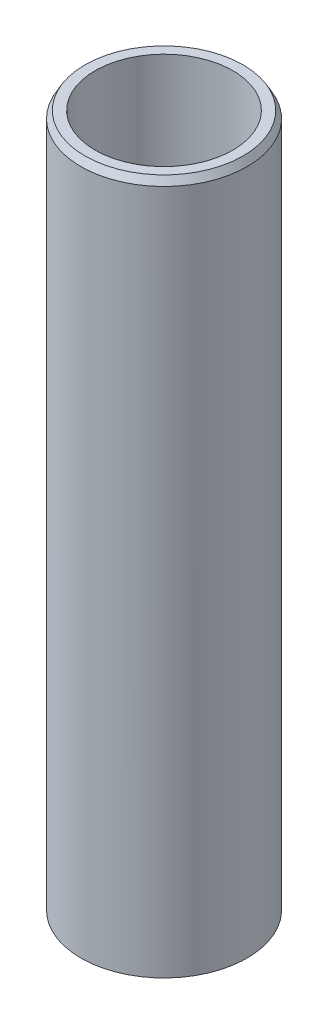
ISO-10303-21;
HEADER;
FILE_DESCRIPTION(('STEP AP214'),'2;1');
FILE_NAME('part.step','',(''),(''),'','','');
FILE_SCHEMA(('AUTOMOTIVE_DESIGN { 1 0 10303 214 1 1 1 1 }'));
ENDSEC;
DATA;
#1=APPLICATION_CONTEXT('core data for automotive mechanical design processes');
#2=APPLICATION_PROTOCOL_DEFINITION('international standard','automotive_design',2000,#1);
#3=PRODUCT_CONTEXT('',#1,'mechanical');
#4=PRODUCT('Part','Part','',(#3));
#5=PRODUCT_RELATED_PRODUCT_CATEGORY('part','',(#4));
#6=PRODUCT_DEFINITION_FORMATION('','',#4);
#7=PRODUCT_DEFINITION_CONTEXT('part definition',#1,'design');
#8=PRODUCT_DEFINITION('design','',#6,#7);
#9=PRODUCT_DEFINITION_SHAPE('','',#8);
#10=(LENGTH_UNIT() NAMED_UNIT(*) SI_UNIT(.MILLI.,.METRE.));
#11=(NAMED_UNIT(*) PLANE_ANGLE_UNIT() SI_UNIT($,.RADIAN.));
#12=(NAMED_UNIT(*) SI_UNIT($,.STERADIAN.) SOLID_ANGLE_UNIT());
#13=UNCERTAINTY_MEASURE_WITH_UNIT(LENGTH_MEASURE(1.E-05),#10,'distance_accuracy_value','');
#14=(GEOMETRIC_REPRESENTATION_CONTEXT(3) GLOBAL_UNCERTAINTY_ASSIGNED_CONTEXT((#13)) GLOBAL_UNIT_ASSIGNED_CONTEXT((#10,
#11,#12)) REPRESENTATION_CONTEXT('',''));
#15=CARTESIAN_POINT('',(0.,0.,0.));
#16=DIRECTION('',(0.,0.,1.));
#17=DIRECTION('',(1.,0.,0.));
#18=AXIS2_PLACEMENT_3D('',#15,#16,#17);
#19=CARTESIAN_POINT('',(0.,460.940624875741,0.));
#20=DIRECTION('',(0.,-1.,0.));
#21=DIRECTION('',(0.,0.,-1.));
#22=AXIS2_PLACEMENT_3D('',#19,#20,#21);
#23=CYLINDRICAL_SURFACE('',#22,55.);
#24=CARTESIAN_POINT('',(0.,456.221799142899,0.));
#25=DIRECTION('',(0.,1.,0.));
#26=DIRECTION('',(0.,0.,1.));
#27=AXIS2_PLACEMENT_3D('',#24,#25,#26);
#28=CIRCLE('',#27,55.);
#29=CARTESIAN_POINT('',(0.,456.221799142899,-55.));
#30=VERTEX_POINT('',#29);
#31=EDGE_CURVE('E50',#30,#30,#28,.F.);
#32=CARTESIAN_POINT('',(0.,2.72441530711542,0.));
#33=DIRECTION('',(0.,1.,0.));
#34=DIRECTION('',(0.,0.,1.));
#35=AXIS2_PLACEMENT_3D('',#32,#33,#34);
#36=CIRCLE('',#35,55.);
#37=CARTESIAN_POINT('',(0.,2.72441530711542,-55.));
#38=VERTEX_POINT('',#37);
#39=EDGE_CURVE('E51',#38,#38,#36,.T.);
#40=CARTESIAN_POINT('',(0.,456.221799142899,-55.));
#41=CARTESIAN_POINT('',(0.,451.497868061276,-55.));
#42=CARTESIAN_POINT('',(0.,446.773936979653,-55.));
#43=CARTESIAN_POINT('',(0.,437.326074816408,-55.));
#44=CARTESIAN_POINT('',(0.,432.602143734785,-55.));
#45=CARTESIAN_POINT('',(0.,423.154281571539,-55.));
#46=CARTESIAN_POINT('',(0.,418.430350489917,-55.));
#47=CARTESIAN_POINT('',(0.,408.982488326671,-55.));
#48=CARTESIAN_POINT('',(0.,404.258557245048,-55.));
#49=CARTESIAN_POINT('',(0.,394.810695081803,-55.));
#50=CARTESIAN_POINT('',(0.,390.08676400018,-55.));
#51=CARTESIAN_POINT('',(0.,380.638901836935,-55.));
#52=CARTESIAN_POINT('',(0.,375.914970755312,-55.));
#53=CARTESIAN_POINT('',(0.,366.467108592066,-55.));
#54=CARTESIAN_POINT('',(0.,361.743177510444,-55.));
#55=CARTESIAN_POINT('',(0.,352.295315347198,-55.));
#56=CARTESIAN_POINT('',(0.,347.571384265575,-55.));
#57=CARTESIAN_POINT('',(0.,338.12352210233,-55.));
#58=CARTESIAN_POINT('',(0.,333.399591020707,-55.));
#59=CARTESIAN_POINT('',(0.,323.951728857462,-55.));
#60=CARTESIAN_POINT('',(0.,319.227797775839,-55.));
#61=CARTESIAN_POINT('',(0.,309.779935612594,-55.));
#62=CARTESIAN_POINT('',(0.,305.056004530971,-55.));
#63=CARTESIAN_POINT('',(0.,295.608142367725,-55.));
#64=CARTESIAN_POINT('',(0.,290.884211286103,-55.));
#65=CARTESIAN_POINT('',(0.,281.436349122857,-55.));
#66=CARTESIAN_POINT('',(0.,276.712418041234,-55.));
#67=CARTESIAN_POINT('',(0.,267.264555877989,-55.));
#68=CARTESIAN_POINT('',(0.,262.540624796366,-55.));
#69=CARTESIAN_POINT('',(0.,253.092762633121,-55.));
#70=CARTESIAN_POINT('',(0.,248.368831551498,-55.));
#71=CARTESIAN_POINT('',(0.,238.920969388252,-55.));
#72=CARTESIAN_POINT('',(0.,234.19703830663,-55.));
#73=CARTESIAN_POINT('',(0.,224.749176143384,-55.));
#74=CARTESIAN_POINT('',(0.,220.025245061761,-55.));
#75=CARTESIAN_POINT('',(0.,210.577382898516,-55.));
#76=CARTESIAN_POINT('',(0.,205.853451816893,-55.));
#77=CARTESIAN_POINT('',(0.,196.405589653648,-55.));
#78=CARTESIAN_POINT('',(0.,191.681658572025,-55.));
#79=CARTESIAN_POINT('',(0.,182.23379640878,-55.));
#80=CARTESIAN_POINT('',(0.,177.509865327157,-55.));
#81=CARTESIAN_POINT('',(0.,168.062003163911,-55.));
#82=CARTESIAN_POINT('',(0.,163.338072082289,-55.));
#83=CARTESIAN_POINT('',(0.,153.890209919043,-55.));
#84=CARTESIAN_POINT('',(0.,149.16627883742,-55.));
#85=CARTESIAN_POINT('',(0.,139.718416674175,-55.));
#86=CARTESIAN_POINT('',(0.,134.994485592552,-55.));
#87=CARTESIAN_POINT('',(0.,125.546623429307,-55.));
#88=CARTESIAN_POINT('',(0.,120.822692347684,-55.));
#89=CARTESIAN_POINT('',(0.,111.374830184438,-55.));
#90=CARTESIAN_POINT('',(0.,106.650899102816,-55.));
#91=CARTESIAN_POINT('',(0.,97.2030369395702,-55.));
#92=CARTESIAN_POINT('',(0.,92.4791058579475,-55.));
#93=CARTESIAN_POINT('',(0.,83.031243694702,-55.));
#94=CARTESIAN_POINT('',(0.,78.3073126130793,-55.));
#95=CARTESIAN_POINT('',(0.,68.8594504498338,-55.));
#96=CARTESIAN_POINT('',(0.,64.135519368211,-55.));
#97=CARTESIAN_POINT('',(0.,54.6876572049656,-55.));
#98=CARTESIAN_POINT('',(0.,49.9637261233428,-55.));
#99=CARTESIAN_POINT('',(0.,40.5158639600973,-55.));
#100=CARTESIAN_POINT('',(0.,35.7919328784746,-55.));
#101=CARTESIAN_POINT('',(0.,26.3440707152291,-55.));
#102=CARTESIAN_POINT('',(0.,21.6201396336064,-55.));
#103=CARTESIAN_POINT('',(0.,12.1722774703609,-55.));
#104=CARTESIAN_POINT('',(0.,7.44834638873814,-55.));
#105=CARTESIAN_POINT('',(0.,2.72441530711542,-55.));
#106=B_SPLINE_CURVE_WITH_KNOTS('',3,(#40,#41,#42,#43,#44,#45,#46,#47,#48,#49,#50,#51,#52,#53,
#54,#55,#56,#57,#58,#59,#60,#61,#62,#63,#64,#65,#66,#67,#68,#69,#70,#71,#72,#73,#74,#75,#76,#77,
#78,#79,#80,#81,#82,#83,#84,#85,#86,#87,#88,#89,#90,#91,#92,#93,#94,#95,#96,#97,#98,#99,#100,
#101,#102,#103,#104,#105),.UNSPECIFIED.,.F.,.F.,(4,2,2,2,2,2,2,2,2,2,2,2,2,2,2,2,2,2,2,2,2,2,2,
2,2,2,2,2,2,2,2,2,4),(0.,14.1717932448682,28.3435864897364,42.5153797346047,56.6871729794729,
70.8589662243411,85.0307594692093,99.2025527140776,113.374345958946,127.546139203814,
141.717932448682,155.88972569355,170.061518938419,184.233312183287,198.405105428155,
212.576898673023,226.748691917892,240.92048516276,255.092278407628,269.264071652496,
283.435864897365,297.607658142233,311.779451387101,325.951244631969,340.123037876837,
354.294831121706,368.466624366574,382.638417611442,396.81021085631,410.982004101178,
425.153797346047,439.325590590915,453.497383835783),.UNSPECIFIED.);
#107=EDGE_CURVE('BSEAM39',#30,#38,#106,.T.);
#108=ORIENTED_EDGE('',*,*,#31,.T.);
#109=ORIENTED_EDGE('',*,*,#39,.T.);
#110=ORIENTED_EDGE('',*,*,#107,.T.);
#111=ORIENTED_EDGE('',*,*,#107,.F.);
#112=EDGE_LOOP('',(#108,#110,#109,#111));
#113=FACE_BOUND('',#112,.T.);
#114=ADVANCED_FACE('F39',(#113),#23,.T.);
#115=CARTESIAN_POINT('',(0.,460.940624875741,0.));
#116=DIRECTION('',(0.,1.,0.));
#117=DIRECTION('',(0.,0.,1.));
#118=AXIS2_PLACEMENT_3D('',#115,#116,#117);
#119=PLANE('',#118);
#120=CARTESIAN_POINT('',(0.,460.940624875741,0.));
#121=DIRECTION('',(0.,1.,0.));
#122=DIRECTION('',(0.,0.,1.));
#123=AXIS2_PLACEMENT_3D('',#120,#121,#122);
#124=CIRCLE('',#123,52.2755846928846);
#125=CARTESIAN_POINT('',(0.,460.940624875741,-52.2755846928847));
#126=VERTEX_POINT('',#125);
#127=EDGE_CURVE('E54',#126,#126,#124,.T.);
#128=ORIENTED_EDGE('',*,*,#127,.T.);
#129=EDGE_LOOP('',(#128));
#130=FACE_BOUND('',#129,.T.);
#131=CARTESIAN_POINT('',(0.,460.940624875741,0.));
#132=DIRECTION('',(0.,1.,0.));
#133=DIRECTION('',(0.,0.,1.));
#134=AXIS2_PLACEMENT_3D('',#131,#132,#133);
#135=CIRCLE('',#134,45.5773509672225);
#136=CARTESIAN_POINT('',(0.,460.940624875741,45.5773509672225));
#137=VERTEX_POINT('',#136);
#138=EDGE_CURVE('E58',#137,#137,#135,.T.);
#139=ORIENTED_EDGE('',*,*,#138,.F.);
#140=EDGE_LOOP('',(#139));
#141=FACE_BOUND('',#140,.T.);
#142=ADVANCED_FACE('F69',(#130,#141),#119,.T.);
#143=CARTESIAN_POINT('',(0.,0.,0.));
#144=DIRECTION('',(0.,1.,0.));
#145=DIRECTION('',(0.,0.,1.));
#146=AXIS2_PLACEMENT_3D('',#143,#144,#145);
#147=PLANE('',#146);
#148=CARTESIAN_POINT('',(0.,0.,0.));
#149=DIRECTION('',(0.,1.,0.));
#150=DIRECTION('',(0.,0.,1.));
#151=AXIS2_PLACEMENT_3D('',#148,#149,#150);
#152=CIRCLE('',#151,50.2811742671577);
#153=CARTESIAN_POINT('',(0.,0.,50.2811742671577));
#154=VERTEX_POINT('',#153);
#155=EDGE_CURVE('E10',#154,#154,#152,.F.);
#156=ORIENTED_EDGE('',*,*,#155,.T.);
#157=EDGE_LOOP('',(#156));
#158=FACE_BOUND('',#157,.T.);
#159=CARTESIAN_POINT('',(0.,0.,0.));
#160=DIRECTION('',(0.,1.,0.));
#161=DIRECTION('',(0.,0.,1.));
#162=AXIS2_PLACEMENT_3D('',#159,#160,#161);
#163=CIRCLE('',#162,45.5773509672225);
#164=CARTESIAN_POINT('',(0.,0.,45.5773509672225));
#165=VERTEX_POINT('',#164);
#166=EDGE_CURVE('E63',#165,#165,#163,.T.);
#167=ORIENTED_EDGE('',*,*,#166,.T.);
#168=EDGE_LOOP('',(#167));
#169=FACE_BOUND('',#168,.T.);
#170=ADVANCED_FACE('F75',(#158,#169),#147,.F.);
#171=CARTESIAN_POINT('',(0.,460.940624875741,0.));
#172=DIRECTION('',(0.,-1.,0.));
#173=DIRECTION('',(0.,0.,-1.));
#174=AXIS2_PLACEMENT_3D('',#171,#172,#173);
#175=CYLINDRICAL_SURFACE('',#174,45.5773509672225);
#176=ORIENTED_EDGE('',*,*,#138,.T.);
#177=EDGE_LOOP('',(#176));
#178=FACE_BOUND('',#177,.T.);
#179=ORIENTED_EDGE('',*,*,#166,.F.);
#180=EDGE_LOOP('',(#179));
#181=FACE_BOUND('',#180,.T.);
#182=ADVANCED_FACE('F70',(#178,#181),#175,.F.);
#183=CARTESIAN_POINT('',(0.,460.940624875741,0.));
#184=DIRECTION('',(0.,-1.,0.));
#185=DIRECTION('',(0.,0.,-1.));
#186=AXIS2_PLACEMENT_3D('',#183,#184,#185);
#187=CONICAL_SURFACE('',#186,52.2755846928846,0.523598775598293);
#188=CARTESIAN_POINT('',(0.,456.221799142898,-55.));
#189=CARTESIAN_POINT('',(0.,456.270953577616,-54.9716206738842));
#190=CARTESIAN_POINT('',(0.,456.320108012333,-54.9432413477684));
#191=CARTESIAN_POINT('',(0.,456.418416881767,-54.8864826955369));
#192=CARTESIAN_POINT('',(0.,456.467571316484,-54.8581033694211));
#193=CARTESIAN_POINT('',(0.,456.565880185918,-54.8013447171895));
#194=CARTESIAN_POINT('',(0.,456.615034620635,-54.7729653910737));
#195=CARTESIAN_POINT('',(0.,456.71334349007,-54.7162067388422));
#196=CARTESIAN_POINT('',(0.,456.762497924787,-54.6878274127264));
#197=CARTESIAN_POINT('',(0.,456.860806794221,-54.6310687604948));
#198=CARTESIAN_POINT('',(0.,456.909961228938,-54.602689434379));
#199=CARTESIAN_POINT('',(0.,457.008270098372,-54.5459307821475));
#200=CARTESIAN_POINT('',(0.,457.057424533089,-54.5175514560317));
#201=CARTESIAN_POINT('',(0.,457.155733402523,-54.4607928038001));
#202=CARTESIAN_POINT('',(0.,457.204887837241,-54.4324134776843));
#203=CARTESIAN_POINT('',(0.,457.303196706675,-54.3756548254527));
#204=CARTESIAN_POINT('',(0.,457.352351141392,-54.347275499337));
#205=CARTESIAN_POINT('',(0.,457.450660010826,-54.2905168471054));
#206=CARTESIAN_POINT('',(0.,457.499814445543,-54.2621375209896));
#207=CARTESIAN_POINT('',(0.,457.598123314977,-54.205378868758));
#208=CARTESIAN_POINT('',(0.,457.647277749695,-54.1769995426423));
#209=CARTESIAN_POINT('',(0.,457.745586619129,-54.1202408904107));
#210=CARTESIAN_POINT('',(0.,457.794741053846,-54.0918615642949));
#211=CARTESIAN_POINT('',(0.,457.89304992328,-54.0351029120633));
#212=CARTESIAN_POINT('',(0.,457.942204357997,-54.0067235859475));
#213=CARTESIAN_POINT('',(0.,458.040513227431,-53.949964933716));
#214=CARTESIAN_POINT('',(0.,458.089667662149,-53.9215856076002));
#215=CARTESIAN_POINT('',(0.,458.187976531583,-53.8648269553686));
#216=CARTESIAN_POINT('',(0.,458.2371309663,-53.8364476292528));
#217=CARTESIAN_POINT('',(0.,458.335439835734,-53.7796889770213));
#218=CARTESIAN_POINT('',(0.,458.384594270451,-53.7513096509055));
#219=CARTESIAN_POINT('',(0.,458.482903139885,-53.6945509986739));
#220=CARTESIAN_POINT('',(0.,458.532057574602,-53.6661716725581));
#221=CARTESIAN_POINT('',(0.,458.630366444037,-53.6094130203266));
#222=CARTESIAN_POINT('',(0.,458.679520878754,-53.5810336942108));
#223=CARTESIAN_POINT('',(0.,458.777829748188,-53.5242750419792));
#224=CARTESIAN_POINT('',(0.,458.826984182905,-53.4958957158634));
#225=CARTESIAN_POINT('',(0.,458.925293052339,-53.4391370636318));
#226=CARTESIAN_POINT('',(0.,458.974447487056,-53.4107577375161));
#227=CARTESIAN_POINT('',(0.,459.072756356491,-53.3539990852845));
#228=CARTESIAN_POINT('',(0.,459.121910791208,-53.3256197591687));
#229=CARTESIAN_POINT('',(0.,459.220219660642,-53.2688611069371));
#230=CARTESIAN_POINT('',(0.,459.269374095359,-53.2404817808214));
#231=CARTESIAN_POINT('',(0.,459.367682964793,-53.1837231285898));
#232=CARTESIAN_POINT('',(0.,459.41683739951,-53.155343802474));
#233=CARTESIAN_POINT('',(0.,459.515146268945,-53.0985851502424));
#234=CARTESIAN_POINT('',(0.,459.564300703662,-53.0702058241266));
#235=CARTESIAN_POINT('',(0.,459.662609573096,-53.0134471718951));
#236=CARTESIAN_POINT('',(0.,459.711764007813,-52.9850678457793));
#237=CARTESIAN_POINT('',(0.,459.810072877247,-52.9283091935477));
#238=CARTESIAN_POINT('',(0.,459.859227311964,-52.8999298674319));
#239=CARTESIAN_POINT('',(0.,459.957536181399,-52.8431712152004));
#240=CARTESIAN_POINT('',(0.,460.006690616116,-52.8147918890846));
#241=CARTESIAN_POINT('',(0.,460.10499948555,-52.758033236853));
#242=CARTESIAN_POINT('',(0.,460.154153920267,-52.7296539107372));
#243=CARTESIAN_POINT('',(0.,460.252462789701,-52.6728952585057));
#244=CARTESIAN_POINT('',(0.,460.301617224418,-52.6445159323899));
#245=CARTESIAN_POINT('',(0.,460.399926093853,-52.5877572801583));
#246=CARTESIAN_POINT('',(0.,460.44908052857,-52.5593779540425));
#247=CARTESIAN_POINT('',(0.,460.547389398004,-52.502619301811));
#248=CARTESIAN_POINT('',(0.,460.596543832721,-52.4742399756952));
#249=CARTESIAN_POINT('',(0.,460.694852702155,-52.4174813234636));
#250=CARTESIAN_POINT('',(0.,460.744007136872,-52.3891019973478));
#251=CARTESIAN_POINT('',(0.,460.842316006306,-52.3323433451162));
#252=CARTESIAN_POINT('',(0.,460.891470441024,-52.3039640190004));
#253=CARTESIAN_POINT('',(0.,460.940624875741,-52.2755846928847));
#254=B_SPLINE_CURVE_WITH_KNOTS('',3,(#188,#189,#190,#191,#192,#193,#194,#195,#196,#197,#198,
#199,#200,#201,#202,#203,#204,#205,#206,#207,#208,#209,#210,#211,#212,#213,#214,#215,#216,#217,
#218,#219,#220,#221,#222,#223,#224,#225,#226,#227,#228,#229,#230,#231,#232,#233,#234,#235,#236,
#237,#238,#239,#240,#241,#242,#243,#244,#245,#246,#247,#248,#249,#250,#251,#252,#253),
.UNSPECIFIED.,.F.,.F.,(4,2,2,2,2,2,2,2,2,2,2,2,2,2,2,2,2,2,2,2,2,2,2,2,2,2,2,2,2,2,2,2,4),(0.,
0.170275956694719,0.340551913389439,0.510827870084158,0.681103826778878,0.851379783473597,
1.02165574016827,1.19193169686299,1.36220765355771,1.53248361025243,1.70275956694715,
1.87303552364182,2.04331148033654,2.21358743703126,2.38386339372598,2.5541393504207,
2.72441530711537,2.89469126381009,3.06496722050481,3.23524317719954,3.40551913389426,
3.57579509058898,3.74607104728365,3.91634700397837,4.08662296067309,4.25689891736781,
4.42717487406253,4.5974508307572,4.76772678745192,4.93800274414664,5.10827870084136,
5.27855465753608,5.4488306142308),.UNSPECIFIED.);
#255=EDGE_CURVE('BSEAM81',#30,#126,#254,.T.);
#256=ORIENTED_EDGE('',*,*,#31,.F.);
#257=ORIENTED_EDGE('',*,*,#127,.F.);
#258=ORIENTED_EDGE('',*,*,#255,.T.);
#259=ORIENTED_EDGE('',*,*,#255,.F.);
#260=EDGE_LOOP('',(#256,#258,#257,#259));
#261=FACE_BOUND('',#260,.T.);
#262=ADVANCED_FACE('F81',(#261),#187,.T.);
#263=CARTESIAN_POINT('',(0.,2.72441530711542,0.));
#264=DIRECTION('',(0.,1.,0.));
#265=DIRECTION('',(0.,0.,1.));
#266=AXIS2_PLACEMENT_3D('',#263,#264,#265);
#267=CONICAL_SURFACE('',#266,55.,1.0471975511966);
#268=ORIENTED_EDGE('',*,*,#155,.F.);
#269=EDGE_LOOP('',(#268));
#270=FACE_BOUND('',#269,.T.);
#271=ORIENTED_EDGE('',*,*,#39,.F.);
#272=EDGE_LOOP('',(#271));
#273=FACE_BOUND('',#272,.T.);
#274=ADVANCED_FACE('F45',(#270,#273),#267,.T.);
#275=CLOSED_SHELL('',(#114,#142,#170,#182,#262,#274));
#276=MANIFOLD_SOLID_BREP('B2',#275);
#277=ADVANCED_BREP_SHAPE_REPRESENTATION('',(#18,#276),#14);
#278=SHAPE_DEFINITION_REPRESENTATION(#9,#277);
ENDSEC;
END-ISO-10303-21;
